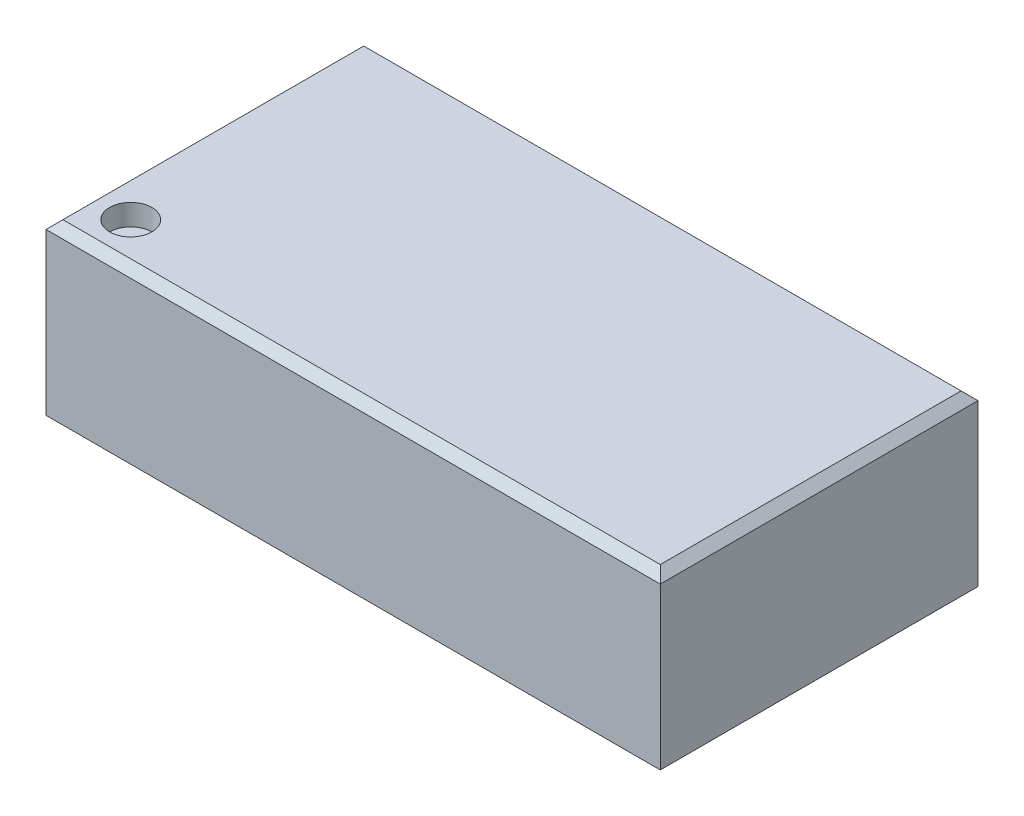
ISO-10303-21;
HEADER;
FILE_DESCRIPTION(('STEP AP214'),'2;1');
FILE_NAME('part.step','',(''),(''),'','','');
FILE_SCHEMA(('AUTOMOTIVE_DESIGN { 1 0 10303 214 1 1 1 1 }'));
ENDSEC;
DATA;
#1=APPLICATION_CONTEXT('core data for automotive mechanical design processes');
#2=APPLICATION_PROTOCOL_DEFINITION('international standard','automotive_design',2000,#1);
#3=PRODUCT_CONTEXT('',#1,'mechanical');
#4=PRODUCT('Part','Part','',(#3));
#5=PRODUCT_RELATED_PRODUCT_CATEGORY('part','',(#4));
#6=PRODUCT_DEFINITION_FORMATION('','',#4);
#7=PRODUCT_DEFINITION_CONTEXT('part definition',#1,'design');
#8=PRODUCT_DEFINITION('design','',#6,#7);
#9=PRODUCT_DEFINITION_SHAPE('','',#8);
#10=(LENGTH_UNIT() NAMED_UNIT(*) SI_UNIT(.MILLI.,.METRE.));
#11=(NAMED_UNIT(*) PLANE_ANGLE_UNIT() SI_UNIT($,.RADIAN.));
#12=(NAMED_UNIT(*) SI_UNIT($,.STERADIAN.) SOLID_ANGLE_UNIT());
#13=UNCERTAINTY_MEASURE_WITH_UNIT(LENGTH_MEASURE(1.E-05),#10,'distance_accuracy_value','');
#14=(GEOMETRIC_REPRESENTATION_CONTEXT(3) GLOBAL_UNCERTAINTY_ASSIGNED_CONTEXT((#13)) GLOBAL_UNIT_ASSIGNED_CONTEXT((#10,
#11,#12)) REPRESENTATION_CONTEXT('',''));
#15=CARTESIAN_POINT('',(0.,0.,0.));
#16=DIRECTION('',(0.,0.,1.));
#17=DIRECTION('',(1.,0.,0.));
#18=AXIS2_PLACEMENT_3D('',#15,#16,#17);
#19=CARTESIAN_POINT('',(-3.625,2.,-1.875));
#20=DIRECTION('',(1.,0.,0.));
#21=DIRECTION('',(0.,0.,-1.));
#22=AXIS2_PLACEMENT_3D('',#19,#20,#21);
#23=PLANE('',#22);
#24=DIRECTION('',(0.,-1.,0.));
#25=VECTOR('',#24,1.);
#26=CARTESIAN_POINT('',(-3.625,2.,1.875));
#27=LINE('',#26,#25);
#28=CARTESIAN_POINT('',(-3.625,1.9,1.875));
#29=VERTEX_POINT('',#28);
#30=CARTESIAN_POINT('',(-3.625,0.,1.875));
#31=VERTEX_POINT('',#30);
#32=EDGE_CURVE('E87',#29,#31,#27,.T.);
#33=ORIENTED_EDGE('',*,*,#32,.F.);
#34=DIRECTION('',(0.,0.,-1.));
#35=VECTOR('',#34,1.);
#36=CARTESIAN_POINT('',(-3.625,1.9,-1.875));
#37=LINE('',#36,#35);
#38=CARTESIAN_POINT('',(-3.625,1.9,-1.875));
#39=VERTEX_POINT('',#38);
#40=EDGE_CURVE('E11',#29,#39,#37,.T.);
#41=ORIENTED_EDGE('',*,*,#40,.T.);
#42=DIRECTION('',(0.,-1.,0.));
#43=VECTOR('',#42,1.);
#44=CARTESIAN_POINT('',(-3.625,2.,-1.875));
#45=LINE('',#44,#43);
#46=CARTESIAN_POINT('',(-3.625,0.,-1.875));
#47=VERTEX_POINT('',#46);
#48=EDGE_CURVE('E104',#39,#47,#45,.T.);
#49=ORIENTED_EDGE('',*,*,#48,.T.);
#50=DIRECTION('',(0.,0.,1.));
#51=VECTOR('',#50,1.);
#52=CARTESIAN_POINT('',(-3.625,0.,-1.875));
#53=LINE('',#52,#51);
#54=EDGE_CURVE('E100',#47,#31,#53,.T.);
#55=ORIENTED_EDGE('',*,*,#54,.T.);
#56=EDGE_LOOP('',(#33,#41,#49,#55));
#57=FACE_BOUND('',#56,.T.);
#58=ADVANCED_FACE('F35',(#57),#23,.F.);
#59=CARTESIAN_POINT('',(-3.625,2.,1.875));
#60=DIRECTION('',(0.,0.,-1.));
#61=DIRECTION('',(-1.,0.,0.));
#62=AXIS2_PLACEMENT_3D('',#59,#60,#61);
#63=PLANE('',#62);
#64=DIRECTION('',(0.,-1.,0.));
#65=VECTOR('',#64,1.);
#66=CARTESIAN_POINT('',(3.625,2.,1.875));
#67=LINE('',#66,#65);
#68=CARTESIAN_POINT('',(3.625,1.9,1.875));
#69=VERTEX_POINT('',#68);
#70=CARTESIAN_POINT('',(3.625,0.,1.875));
#71=VERTEX_POINT('',#70);
#72=EDGE_CURVE('E94',#69,#71,#67,.T.);
#73=ORIENTED_EDGE('',*,*,#72,.F.);
#74=DIRECTION('',(-1.,0.,0.));
#75=VECTOR('',#74,1.);
#76=CARTESIAN_POINT('',(-3.625,1.9,1.875));
#77=LINE('',#76,#75);
#78=EDGE_CURVE('E58',#69,#29,#77,.T.);
#79=ORIENTED_EDGE('',*,*,#78,.T.);
#80=ORIENTED_EDGE('',*,*,#32,.T.);
#81=DIRECTION('',(1.,0.,0.));
#82=VECTOR('',#81,1.);
#83=CARTESIAN_POINT('',(-3.625,0.,1.875));
#84=LINE('',#83,#82);
#85=EDGE_CURVE('E90',#31,#71,#84,.T.);
#86=ORIENTED_EDGE('',*,*,#85,.T.);
#87=EDGE_LOOP('',(#73,#79,#80,#86));
#88=FACE_BOUND('',#87,.T.);
#89=ADVANCED_FACE('F89',(#88),#63,.F.);
#90=CARTESIAN_POINT('',(3.625,2.,-1.875));
#91=DIRECTION('',(-1.,0.,0.));
#92=DIRECTION('',(0.,0.,1.));
#93=AXIS2_PLACEMENT_3D('',#90,#91,#92);
#94=PLANE('',#93);
#95=DIRECTION('',(0.,-1.,0.));
#96=VECTOR('',#95,1.);
#97=CARTESIAN_POINT('',(3.625,2.,-1.875));
#98=LINE('',#97,#96);
#99=CARTESIAN_POINT('',(3.625,1.9,-1.875));
#100=VERTEX_POINT('',#99);
#101=CARTESIAN_POINT('',(3.625,0.,-1.875));
#102=VERTEX_POINT('',#101);
#103=EDGE_CURVE('E117',#100,#102,#98,.T.);
#104=ORIENTED_EDGE('',*,*,#103,.F.);
#105=DIRECTION('',(0.,0.,1.));
#106=VECTOR('',#105,1.);
#107=CARTESIAN_POINT('',(3.625,1.9,1.875));
#108=LINE('',#107,#106);
#109=EDGE_CURVE('E128',#100,#69,#108,.T.);
#110=ORIENTED_EDGE('',*,*,#109,.T.);
#111=ORIENTED_EDGE('',*,*,#72,.T.);
#112=DIRECTION('',(0.,0.,-1.));
#113=VECTOR('',#112,1.);
#114=CARTESIAN_POINT('',(3.625,0.,-1.875));
#115=LINE('',#114,#113);
#116=EDGE_CURVE('E102',#71,#102,#115,.T.);
#117=ORIENTED_EDGE('',*,*,#116,.T.);
#118=EDGE_LOOP('',(#104,#110,#111,#117));
#119=FACE_BOUND('',#118,.T.);
#120=ADVANCED_FACE('F161',(#119),#94,.F.);
#121=CARTESIAN_POINT('',(-3.625,2.,-1.875));
#122=DIRECTION('',(0.,0.,1.));
#123=DIRECTION('',(1.,0.,0.));
#124=AXIS2_PLACEMENT_3D('',#121,#122,#123);
#125=PLANE('',#124);
#126=ORIENTED_EDGE('',*,*,#48,.F.);
#127=DIRECTION('',(1.,0.,0.));
#128=VECTOR('',#127,1.);
#129=CARTESIAN_POINT('',(3.625,1.9,-1.875));
#130=LINE('',#129,#128);
#131=EDGE_CURVE('E44',#39,#100,#130,.T.);
#132=ORIENTED_EDGE('',*,*,#131,.T.);
#133=ORIENTED_EDGE('',*,*,#103,.T.);
#134=DIRECTION('',(-1.,0.,0.));
#135=VECTOR('',#134,1.);
#136=CARTESIAN_POINT('',(-3.625,0.,-1.875));
#137=LINE('',#136,#135);
#138=EDGE_CURVE('E114',#102,#47,#137,.T.);
#139=ORIENTED_EDGE('',*,*,#138,.T.);
#140=EDGE_LOOP('',(#126,#132,#133,#139));
#141=FACE_BOUND('',#140,.T.);
#142=ADVANCED_FACE('F153',(#141),#125,.F.);
#143=CARTESIAN_POINT('',(0.,2.,0.));
#144=DIRECTION('',(0.,1.,0.));
#145=DIRECTION('',(0.,0.,1.));
#146=AXIS2_PLACEMENT_3D('',#143,#144,#145);
#147=PLANE('',#146);
#148=DIRECTION('',(1.,0.,0.));
#149=VECTOR('',#148,1.);
#150=CARTESIAN_POINT('',(3.625,2.,1.775));
#151=LINE('',#150,#149);
#152=CARTESIAN_POINT('',(-3.525,2.,1.775));
#153=VERTEX_POINT('',#152);
#154=CARTESIAN_POINT('',(3.525,2.,1.775));
#155=VERTEX_POINT('',#154);
#156=EDGE_CURVE('E123',#153,#155,#151,.T.);
#157=ORIENTED_EDGE('',*,*,#156,.T.);
#158=DIRECTION('',(0.,0.,-1.));
#159=VECTOR('',#158,1.);
#160=CARTESIAN_POINT('',(3.525,2.,-1.875));
#161=LINE('',#160,#159);
#162=CARTESIAN_POINT('',(3.525,2.,-1.775));
#163=VERTEX_POINT('',#162);
#164=EDGE_CURVE('E125',#155,#163,#161,.T.);
#165=ORIENTED_EDGE('',*,*,#164,.T.);
#166=DIRECTION('',(-1.,0.,0.));
#167=VECTOR('',#166,1.);
#168=CARTESIAN_POINT('',(-3.625,2.,-1.775));
#169=LINE('',#168,#167);
#170=CARTESIAN_POINT('',(-3.525,2.,-1.775));
#171=VERTEX_POINT('',#170);
#172=EDGE_CURVE('E121',#163,#171,#169,.T.);
#173=ORIENTED_EDGE('',*,*,#172,.T.);
#174=DIRECTION('',(0.,0.,1.));
#175=VECTOR('',#174,1.);
#176=CARTESIAN_POINT('',(-3.525,2.,1.875));
#177=LINE('',#176,#175);
#178=EDGE_CURVE('E93',#171,#153,#177,.T.);
#179=ORIENTED_EDGE('',*,*,#178,.T.);
#180=EDGE_LOOP('',(#157,#165,#173,#179));
#181=FACE_BOUND('',#180,.T.);
#182=CARTESIAN_POINT('',(-3.125,2.,1.375));
#183=DIRECTION('',(0.,1.,0.));
#184=DIRECTION('',(0.,0.,1.));
#185=AXIS2_PLACEMENT_3D('',#182,#183,#184);
#186=CIRCLE('',#185,0.25);
#187=CARTESIAN_POINT('',(-3.125,2.,1.625));
#188=VERTEX_POINT('',#187);
#189=EDGE_CURVE('E109',#188,#188,#186,.T.);
#190=ORIENTED_EDGE('',*,*,#189,.F.);
#191=EDGE_LOOP('',(#190));
#192=FACE_BOUND('',#191,.T.);
#193=ADVANCED_FACE('F151',(#181,#192),#147,.T.);
#194=CARTESIAN_POINT('',(0.,0.,0.));
#195=DIRECTION('',(0.,1.,0.));
#196=DIRECTION('',(0.,0.,1.));
#197=AXIS2_PLACEMENT_3D('',#194,#195,#196);
#198=PLANE('',#197);
#199=ORIENTED_EDGE('',*,*,#54,.F.);
#200=ORIENTED_EDGE('',*,*,#138,.F.);
#201=ORIENTED_EDGE('',*,*,#116,.F.);
#202=ORIENTED_EDGE('',*,*,#85,.F.);
#203=EDGE_LOOP('',(#199,#200,#201,#202));
#204=FACE_BOUND('',#203,.T.);
#205=ADVANCED_FACE('F98',(#204),#198,.F.);
#206=CARTESIAN_POINT('',(-3.125,1.75,1.375));
#207=DIRECTION('',(0.,1.,0.));
#208=DIRECTION('',(0.,0.,1.));
#209=AXIS2_PLACEMENT_3D('',#206,#207,#208);
#210=CYLINDRICAL_SURFACE('',#209,0.25);
#211=CARTESIAN_POINT('',(-3.125,1.75,1.375));
#212=DIRECTION('',(0.,1.,0.));
#213=DIRECTION('',(0.,0.,1.));
#214=AXIS2_PLACEMENT_3D('',#211,#212,#213);
#215=CIRCLE('',#214,0.25);
#216=CARTESIAN_POINT('',(-3.125,1.75,1.625));
#217=VERTEX_POINT('',#216);
#218=EDGE_CURVE('E106',#217,#217,#215,.T.);
#219=ORIENTED_EDGE('',*,*,#218,.F.);
#220=EDGE_LOOP('',(#219));
#221=FACE_BOUND('',#220,.T.);
#222=ORIENTED_EDGE('',*,*,#189,.T.);
#223=EDGE_LOOP('',(#222));
#224=FACE_BOUND('',#223,.T.);
#225=ADVANCED_FACE('F149',(#221,#224),#210,.F.);
#226=CARTESIAN_POINT('',(-3.125,1.75,1.375));
#227=DIRECTION('',(0.,1.,0.));
#228=DIRECTION('',(0.,0.,1.));
#229=AXIS2_PLACEMENT_3D('',#226,#227,#228);
#230=PLANE('',#229);
#231=ORIENTED_EDGE('',*,*,#218,.T.);
#232=EDGE_LOOP('',(#231));
#233=FACE_BOUND('',#232,.T.);
#234=ADVANCED_FACE('F184',(#233),#230,.T.);
#235=CARTESIAN_POINT('',(-3.525,2.,0.));
#236=DIRECTION('',(-0.707106781186548,0.707106781186548,0.));
#237=DIRECTION('',(0.,0.,-1.));
#238=AXIS2_PLACEMENT_3D('',#235,#236,#237);
#239=PLANE('',#238);
#240=DIRECTION('',(-0.577350269189626,-0.577350269189626,-0.577350269189626));
#241=VECTOR('',#240,1.);
#242=CARTESIAN_POINT('',(-2.93333333333333,2.59166666666667,-1.18333333333333));
#243=LINE('',#242,#241);
#244=EDGE_CURVE('E136',#39,#171,#243,.F.);
#245=ORIENTED_EDGE('',*,*,#244,.F.);
#246=ORIENTED_EDGE('',*,*,#40,.F.);
#247=DIRECTION('',(0.577350269189626,0.577350269189626,-0.577350269189626));
#248=VECTOR('',#247,1.);
#249=CARTESIAN_POINT('',(-2.93333333333333,2.59166666666667,1.18333333333333));
#250=LINE('',#249,#248);
#251=EDGE_CURVE('E39',#153,#29,#250,.F.);
#252=ORIENTED_EDGE('',*,*,#251,.F.);
#253=ORIENTED_EDGE('',*,*,#178,.F.);
#254=EDGE_LOOP('',(#245,#246,#252,#253));
#255=FACE_BOUND('',#254,.T.);
#256=ADVANCED_FACE('F37',(#255),#239,.T.);
#257=CARTESIAN_POINT('',(0.,2.,1.775));
#258=DIRECTION('',(0.,0.707106781186548,0.707106781186548));
#259=DIRECTION('',(-1.,0.,0.));
#260=AXIS2_PLACEMENT_3D('',#257,#258,#259);
#261=PLANE('',#260);
#262=ORIENTED_EDGE('',*,*,#251,.T.);
#263=ORIENTED_EDGE('',*,*,#78,.F.);
#264=DIRECTION('',(-0.577350269189626,0.577350269189626,-0.577350269189626));
#265=VECTOR('',#264,1.);
#266=CARTESIAN_POINT('',(2.35,3.175,0.599999999999997));
#267=LINE('',#266,#265);
#268=EDGE_CURVE('E135',#155,#69,#267,.F.);
#269=ORIENTED_EDGE('',*,*,#268,.F.);
#270=ORIENTED_EDGE('',*,*,#156,.F.);
#271=EDGE_LOOP('',(#262,#263,#269,#270));
#272=FACE_BOUND('',#271,.T.);
#273=ADVANCED_FACE('F179',(#272),#261,.T.);
#274=CARTESIAN_POINT('',(0.,2.,-1.775));
#275=DIRECTION('',(0.,0.707106781186548,-0.707106781186548));
#276=DIRECTION('',(1.,0.,0.));
#277=AXIS2_PLACEMENT_3D('',#274,#275,#276);
#278=PLANE('',#277);
#279=ORIENTED_EDGE('',*,*,#244,.T.);
#280=ORIENTED_EDGE('',*,*,#172,.F.);
#281=DIRECTION('',(0.577350269189626,-0.577350269189626,-0.577350269189626));
#282=VECTOR('',#281,1.);
#283=CARTESIAN_POINT('',(2.35,3.175,-0.599999999999999));
#284=LINE('',#283,#282);
#285=EDGE_CURVE('E133',#100,#163,#284,.F.);
#286=ORIENTED_EDGE('',*,*,#285,.F.);
#287=ORIENTED_EDGE('',*,*,#131,.F.);
#288=EDGE_LOOP('',(#279,#280,#286,#287));
#289=FACE_BOUND('',#288,.T.);
#290=ADVANCED_FACE('F176',(#289),#278,.T.);
#291=CARTESIAN_POINT('',(3.525,2.,0.));
#292=DIRECTION('',(0.707106781186548,0.707106781186548,0.));
#293=DIRECTION('',(0.,0.,1.));
#294=AXIS2_PLACEMENT_3D('',#291,#292,#293);
#295=PLANE('',#294);
#296=ORIENTED_EDGE('',*,*,#268,.T.);
#297=ORIENTED_EDGE('',*,*,#109,.F.);
#298=ORIENTED_EDGE('',*,*,#285,.T.);
#299=ORIENTED_EDGE('',*,*,#164,.F.);
#300=EDGE_LOOP('',(#296,#297,#298,#299));
#301=FACE_BOUND('',#300,.T.);
#302=ADVANCED_FACE('F173',(#301),#295,.T.);
#303=CLOSED_SHELL('',(#58,#89,#120,#142,#193,#205,#225,#234,#256,#273,#290,#302));
#304=MANIFOLD_SOLID_BREP('B2',#303);
#305=ADVANCED_BREP_SHAPE_REPRESENTATION('',(#18,#304),#14);
#306=SHAPE_DEFINITION_REPRESENTATION(#9,#305);
ENDSEC;
END-ISO-10303-21;
